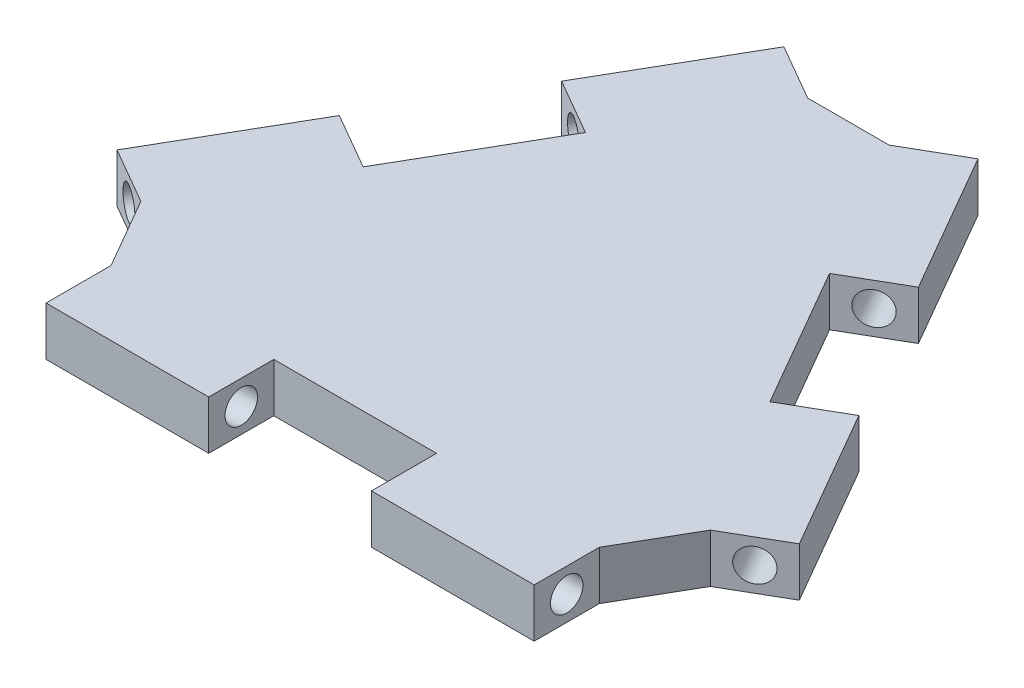
ISO-10303-21;
HEADER;
FILE_DESCRIPTION(('STEP AP214'),'2;1');
FILE_NAME('part.step','',(''),(''),'','','');
FILE_SCHEMA(('AUTOMOTIVE_DESIGN { 1 0 10303 214 1 1 1 1 }'));
ENDSEC;
DATA;
#1=APPLICATION_CONTEXT('core data for automotive mechanical design processes');
#2=APPLICATION_PROTOCOL_DEFINITION('international standard','automotive_design',2000,#1);
#3=PRODUCT_CONTEXT('',#1,'mechanical');
#4=PRODUCT('Part','Part','',(#3));
#5=PRODUCT_RELATED_PRODUCT_CATEGORY('part','',(#4));
#6=PRODUCT_DEFINITION_FORMATION('','',#4);
#7=PRODUCT_DEFINITION_CONTEXT('part definition',#1,'design');
#8=PRODUCT_DEFINITION('design','',#6,#7);
#9=PRODUCT_DEFINITION_SHAPE('','',#8);
#10=(LENGTH_UNIT() NAMED_UNIT(*) SI_UNIT(.MILLI.,.METRE.));
#11=(NAMED_UNIT(*) PLANE_ANGLE_UNIT() SI_UNIT($,.RADIAN.));
#12=(NAMED_UNIT(*) SI_UNIT($,.STERADIAN.) SOLID_ANGLE_UNIT());
#13=UNCERTAINTY_MEASURE_WITH_UNIT(LENGTH_MEASURE(1.E-05),#10,'distance_accuracy_value','');
#14=(GEOMETRIC_REPRESENTATION_CONTEXT(3) GLOBAL_UNCERTAINTY_ASSIGNED_CONTEXT((#13)) GLOBAL_UNIT_ASSIGNED_CONTEXT((#10,
#11,#12)) REPRESENTATION_CONTEXT('',''));
#15=CARTESIAN_POINT('',(0.,0.,0.));
#16=DIRECTION('',(0.,0.,1.));
#17=DIRECTION('',(1.,0.,0.));
#18=AXIS2_PLACEMENT_3D('',#15,#16,#17);
#19=CARTESIAN_POINT('',(-2.49999999999999,3.,4.33012701892219));
#20=DIRECTION('',(-0.499999999999999,0.,0.866025403784439));
#21=DIRECTION('',(0.866025403784439,0.,0.499999999999999));
#22=AXIS2_PLACEMENT_3D('',#19,#20,#21);
#23=PLANE('',#22);
#24=CARTESIAN_POINT('',(-19.2320508075689,1.5,-5.33012701892219));
#25=DIRECTION('',(0.499999999999999,0.,-0.866025403784439));
#26=DIRECTION('',(-0.866025403784439,0.,-0.5));
#27=AXIS2_PLACEMENT_3D('',#24,#25,#26);
#28=CIRCLE('',#27,1.00000000000001);
#29=CARTESIAN_POINT('',(-20.0980762113533,1.5,-5.83012701892219));
#30=VERTEX_POINT('',#29);
#31=EDGE_CURVE('E444',#30,#30,#28,.T.);
#32=ORIENTED_EDGE('',*,*,#31,.T.);
#33=EDGE_LOOP('',(#32));
#34=FACE_BOUND('',#33,.T.);
#35=DIRECTION('',(-0.866025403784439,0.,-0.499999999999999));
#36=VECTOR('',#35,1.);
#37=CARTESIAN_POINT('',(-2.49999999999999,0.,4.33012701892219));
#38=LINE('',#37,#36);
#39=CARTESIAN_POINT('',(-17.5,0.,-4.33012701892219));
#40=VERTEX_POINT('',#39);
#41=CARTESIAN_POINT('',(-20.9641016151378,0.,-6.33012701892219));
#42=VERTEX_POINT('',#41);
#43=EDGE_CURVE('E221',#40,#42,#38,.T.);
#44=ORIENTED_EDGE('',*,*,#43,.F.);
#45=DIRECTION('',(0.,-1.,0.));
#46=VECTOR('',#45,1.);
#47=CARTESIAN_POINT('',(-17.5,3.,-4.33012701892219));
#48=LINE('',#47,#46);
#49=CARTESIAN_POINT('',(-17.5,3.,-4.33012701892219));
#50=VERTEX_POINT('',#49);
#51=EDGE_CURVE('E325',#50,#40,#48,.T.);
#52=ORIENTED_EDGE('',*,*,#51,.F.);
#53=DIRECTION('',(-0.866025403784439,0.,-0.499999999999999));
#54=VECTOR('',#53,1.);
#55=CARTESIAN_POINT('',(-2.49999999999999,3.,4.33012701892219));
#56=LINE('',#55,#54);
#57=CARTESIAN_POINT('',(-20.9641016151378,3.,-6.33012701892219));
#58=VERTEX_POINT('',#57);
#59=EDGE_CURVE('E272',#50,#58,#56,.T.);
#60=ORIENTED_EDGE('',*,*,#59,.T.);
#61=DIRECTION('',(0.,-1.,0.));
#62=VECTOR('',#61,1.);
#63=CARTESIAN_POINT('',(-20.9641016151378,3.,-6.33012701892219));
#64=LINE('',#63,#62);
#65=EDGE_CURVE('E67',#58,#42,#64,.T.);
#66=ORIENTED_EDGE('',*,*,#65,.T.);
#67=EDGE_LOOP('',(#44,#52,#60,#66));
#68=FACE_BOUND('',#67,.T.);
#69=ADVANCED_FACE('F49',(#34,#68),#23,.T.);
#70=CARTESIAN_POINT('',(-15.,3.,0.));
#71=DIRECTION('',(1.,0.,0.));
#72=DIRECTION('',(0.,0.,-1.));
#73=AXIS2_PLACEMENT_3D('',#70,#71,#72);
#74=PLANE('',#73);
#75=CARTESIAN_POINT('',(-15.,1.5,2.00000000000004));
#76=DIRECTION('',(1.,0.,0.));
#77=DIRECTION('',(0.,0.,-1.));
#78=AXIS2_PLACEMENT_3D('',#75,#76,#77);
#79=CIRCLE('',#78,1.);
#80=CARTESIAN_POINT('',(-15.,1.5,1.00000000000004));
#81=VERTEX_POINT('',#80);
#82=EDGE_CURVE('E361',#81,#81,#79,.T.);
#83=ORIENTED_EDGE('',*,*,#82,.T.);
#84=EDGE_LOOP('',(#83));
#85=FACE_BOUND('',#84,.T.);
#86=DIRECTION('',(0.,0.,1.));
#87=VECTOR('',#86,1.);
#88=CARTESIAN_POINT('',(-15.,0.,0.));
#89=LINE('',#88,#87);
#90=CARTESIAN_POINT('',(-15.,0.,0.));
#91=VERTEX_POINT('',#90);
#92=CARTESIAN_POINT('',(-15.,0.,3.99999999999999));
#93=VERTEX_POINT('',#92);
#94=EDGE_CURVE('E223',#91,#93,#89,.T.);
#95=ORIENTED_EDGE('',*,*,#94,.T.);
#96=DIRECTION('',(0.,-1.,0.));
#97=VECTOR('',#96,1.);
#98=CARTESIAN_POINT('',(-15.,3.,3.99999999999999));
#99=LINE('',#98,#97);
#100=CARTESIAN_POINT('',(-15.,3.,3.99999999999999));
#101=VERTEX_POINT('',#100);
#102=EDGE_CURVE('E319',#101,#93,#99,.T.);
#103=ORIENTED_EDGE('',*,*,#102,.F.);
#104=DIRECTION('',(0.,0.,1.));
#105=VECTOR('',#104,1.);
#106=CARTESIAN_POINT('',(-15.,3.,0.));
#107=LINE('',#106,#105);
#108=CARTESIAN_POINT('',(-15.,3.,0.));
#109=VERTEX_POINT('',#108);
#110=EDGE_CURVE('E146',#109,#101,#107,.T.);
#111=ORIENTED_EDGE('',*,*,#110,.F.);
#112=DIRECTION('',(0.,-1.,0.));
#113=VECTOR('',#112,1.);
#114=CARTESIAN_POINT('',(-15.,3.,0.));
#115=LINE('',#114,#113);
#116=EDGE_CURVE('E322',#109,#91,#115,.T.);
#117=ORIENTED_EDGE('',*,*,#116,.T.);
#118=EDGE_LOOP('',(#95,#103,#111,#117));
#119=FACE_BOUND('',#118,.T.);
#120=ADVANCED_FACE('F435',(#85,#119),#74,.F.);
#121=CARTESIAN_POINT('',(0.,3.,4.));
#122=DIRECTION('',(0.,0.,-1.));
#123=DIRECTION('',(-1.,0.,0.));
#124=AXIS2_PLACEMENT_3D('',#121,#122,#123);
#125=PLANE('',#124);
#126=DIRECTION('',(1.,0.,0.));
#127=VECTOR('',#126,1.);
#128=CARTESIAN_POINT('',(0.,0.,4.));
#129=LINE('',#128,#127);
#130=CARTESIAN_POINT('',(-5.00000000000001,0.,4.));
#131=VERTEX_POINT('',#130);
#132=EDGE_CURVE('E226',#93,#131,#129,.T.);
#133=ORIENTED_EDGE('',*,*,#132,.T.);
#134=DIRECTION('',(0.,-1.,0.));
#135=VECTOR('',#134,1.);
#136=CARTESIAN_POINT('',(-5.00000000000001,3.,4.));
#137=LINE('',#136,#135);
#138=CARTESIAN_POINT('',(-5.00000000000001,3.,4.));
#139=VERTEX_POINT('',#138);
#140=EDGE_CURVE('E316',#139,#131,#137,.T.);
#141=ORIENTED_EDGE('',*,*,#140,.F.);
#142=DIRECTION('',(1.,0.,0.));
#143=VECTOR('',#142,1.);
#144=CARTESIAN_POINT('',(0.,3.,4.));
#145=LINE('',#144,#143);
#146=EDGE_CURVE('E374',#101,#139,#145,.T.);
#147=ORIENTED_EDGE('',*,*,#146,.F.);
#148=ORIENTED_EDGE('',*,*,#102,.T.);
#149=EDGE_LOOP('',(#133,#141,#147,#148));
#150=FACE_BOUND('',#149,.T.);
#151=ADVANCED_FACE('F440',(#150),#125,.F.);
#152=CARTESIAN_POINT('',(-5.00000000000001,3.,0.));
#153=DIRECTION('',(-1.,0.,0.));
#154=DIRECTION('',(0.,0.,1.));
#155=AXIS2_PLACEMENT_3D('',#152,#153,#154);
#156=PLANE('',#155);
#157=CARTESIAN_POINT('',(-5.00000000000001,1.5,2.00000000000002));
#158=DIRECTION('',(-1.,0.,0.));
#159=DIRECTION('',(0.,0.,1.));
#160=AXIS2_PLACEMENT_3D('',#157,#158,#159);
#161=CIRCLE('',#160,1.);
#162=CARTESIAN_POINT('',(-5.00000000000001,1.5,3.00000000000003));
#163=VERTEX_POINT('',#162);
#164=EDGE_CURVE('E358',#163,#163,#161,.T.);
#165=ORIENTED_EDGE('',*,*,#164,.T.);
#166=EDGE_LOOP('',(#165));
#167=FACE_BOUND('',#166,.T.);
#168=DIRECTION('',(0.,0.,-1.));
#169=VECTOR('',#168,1.);
#170=CARTESIAN_POINT('',(-5.00000000000001,0.,0.));
#171=LINE('',#170,#169);
#172=CARTESIAN_POINT('',(-5.00000000000001,0.,0.));
#173=VERTEX_POINT('',#172);
#174=EDGE_CURVE('E228',#131,#173,#171,.T.);
#175=ORIENTED_EDGE('',*,*,#174,.T.);
#176=DIRECTION('',(0.,-1.,0.));
#177=VECTOR('',#176,1.);
#178=CARTESIAN_POINT('',(-5.00000000000001,3.,0.));
#179=LINE('',#178,#177);
#180=CARTESIAN_POINT('',(-5.00000000000001,3.,0.));
#181=VERTEX_POINT('',#180);
#182=EDGE_CURVE('E313',#181,#173,#179,.T.);
#183=ORIENTED_EDGE('',*,*,#182,.F.);
#184=DIRECTION('',(0.,0.,-1.));
#185=VECTOR('',#184,1.);
#186=CARTESIAN_POINT('',(-5.00000000000001,3.,0.));
#187=LINE('',#186,#185);
#188=EDGE_CURVE('E376',#139,#181,#187,.T.);
#189=ORIENTED_EDGE('',*,*,#188,.F.);
#190=ORIENTED_EDGE('',*,*,#140,.T.);
#191=EDGE_LOOP('',(#175,#183,#189,#190));
#192=FACE_BOUND('',#191,.T.);
#193=ADVANCED_FACE('F466',(#167,#192),#156,.F.);
#194=CARTESIAN_POINT('',(0.,3.,0.));
#195=DIRECTION('',(0.,0.,-1.));
#196=DIRECTION('',(-1.,0.,0.));
#197=AXIS2_PLACEMENT_3D('',#194,#195,#196);
#198=PLANE('',#197);
#199=DIRECTION('',(1.,0.,0.));
#200=VECTOR('',#199,1.);
#201=CARTESIAN_POINT('',(0.,0.,0.));
#202=LINE('',#201,#200);
#203=CARTESIAN_POINT('',(5.,0.,0.));
#204=VERTEX_POINT('',#203);
#205=EDGE_CURVE('E230',#173,#204,#202,.T.);
#206=ORIENTED_EDGE('',*,*,#205,.T.);
#207=DIRECTION('',(0.,-1.,0.));
#208=VECTOR('',#207,1.);
#209=CARTESIAN_POINT('',(5.,3.,0.));
#210=LINE('',#209,#208);
#211=CARTESIAN_POINT('',(5.,3.,0.));
#212=VERTEX_POINT('',#211);
#213=EDGE_CURVE('E311',#212,#204,#210,.T.);
#214=ORIENTED_EDGE('',*,*,#213,.F.);
#215=DIRECTION('',(1.,0.,0.));
#216=VECTOR('',#215,1.);
#217=CARTESIAN_POINT('',(0.,3.,0.));
#218=LINE('',#217,#216);
#219=EDGE_CURVE('E378',#181,#212,#218,.T.);
#220=ORIENTED_EDGE('',*,*,#219,.F.);
#221=ORIENTED_EDGE('',*,*,#182,.T.);
#222=EDGE_LOOP('',(#206,#214,#220,#221));
#223=FACE_BOUND('',#222,.T.);
#224=ADVANCED_FACE('F470',(#223),#198,.F.);
#225=CARTESIAN_POINT('',(5.,3.,0.));
#226=DIRECTION('',(-1.,0.,0.));
#227=DIRECTION('',(0.,0.,1.));
#228=AXIS2_PLACEMENT_3D('',#225,#226,#227);
#229=PLANE('',#228);
#230=CARTESIAN_POINT('',(5.,1.5,2.00000000000001));
#231=DIRECTION('',(-1.,0.,0.));
#232=DIRECTION('',(0.,0.,1.));
#233=AXIS2_PLACEMENT_3D('',#230,#231,#232);
#234=CIRCLE('',#233,1.);
#235=CARTESIAN_POINT('',(5.00000000000001,1.5,3.00000000000001));
#236=VERTEX_POINT('',#235);
#237=EDGE_CURVE('E355',#236,#236,#234,.T.);
#238=ORIENTED_EDGE('',*,*,#237,.F.);
#239=EDGE_LOOP('',(#238));
#240=FACE_BOUND('',#239,.T.);
#241=DIRECTION('',(0.,0.,-1.));
#242=VECTOR('',#241,1.);
#243=CARTESIAN_POINT('',(5.,0.,0.));
#244=LINE('',#243,#242);
#245=CARTESIAN_POINT('',(5.00000000000001,0.,4.));
#246=VERTEX_POINT('',#245);
#247=EDGE_CURVE('E233',#246,#204,#244,.T.);
#248=ORIENTED_EDGE('',*,*,#247,.F.);
#249=DIRECTION('',(0.,-1.,0.));
#250=VECTOR('',#249,1.);
#251=CARTESIAN_POINT('',(5.00000000000001,3.,4.));
#252=LINE('',#251,#250);
#253=CARTESIAN_POINT('',(5.00000000000001,3.,4.));
#254=VERTEX_POINT('',#253);
#255=EDGE_CURVE('E309',#254,#246,#252,.T.);
#256=ORIENTED_EDGE('',*,*,#255,.F.);
#257=DIRECTION('',(0.,0.,-1.));
#258=VECTOR('',#257,1.);
#259=CARTESIAN_POINT('',(5.,3.,0.));
#260=LINE('',#259,#258);
#261=EDGE_CURVE('E380',#254,#212,#260,.T.);
#262=ORIENTED_EDGE('',*,*,#261,.T.);
#263=ORIENTED_EDGE('',*,*,#213,.T.);
#264=EDGE_LOOP('',(#248,#256,#262,#263));
#265=FACE_BOUND('',#264,.T.);
#266=ADVANCED_FACE('F473',(#240,#265),#229,.T.);
#267=CARTESIAN_POINT('',(0.,3.,4.));
#268=DIRECTION('',(0.,0.,1.));
#269=DIRECTION('',(1.,0.,0.));
#270=AXIS2_PLACEMENT_3D('',#267,#268,#269);
#271=PLANE('',#270);
#272=DIRECTION('',(-1.,0.,0.));
#273=VECTOR('',#272,1.);
#274=CARTESIAN_POINT('',(0.,0.,4.));
#275=LINE('',#274,#273);
#276=CARTESIAN_POINT('',(15.,0.,4.));
#277=VERTEX_POINT('',#276);
#278=EDGE_CURVE('E236',#277,#246,#275,.T.);
#279=ORIENTED_EDGE('',*,*,#278,.F.);
#280=DIRECTION('',(0.,-1.,0.));
#281=VECTOR('',#280,1.);
#282=CARTESIAN_POINT('',(15.,3.,4.));
#283=LINE('',#282,#281);
#284=CARTESIAN_POINT('',(15.,3.,4.));
#285=VERTEX_POINT('',#284);
#286=EDGE_CURVE('E307',#285,#277,#283,.T.);
#287=ORIENTED_EDGE('',*,*,#286,.F.);
#288=DIRECTION('',(-1.,0.,0.));
#289=VECTOR('',#288,1.);
#290=CARTESIAN_POINT('',(0.,3.,4.));
#291=LINE('',#290,#289);
#292=EDGE_CURVE('E383',#285,#254,#291,.T.);
#293=ORIENTED_EDGE('',*,*,#292,.T.);
#294=ORIENTED_EDGE('',*,*,#255,.T.);
#295=EDGE_LOOP('',(#279,#287,#293,#294));
#296=FACE_BOUND('',#295,.T.);
#297=ADVANCED_FACE('F478',(#296),#271,.T.);
#298=CARTESIAN_POINT('',(15.,3.,0.));
#299=DIRECTION('',(1.,0.,0.));
#300=DIRECTION('',(0.,0.,-1.));
#301=AXIS2_PLACEMENT_3D('',#298,#299,#300);
#302=PLANE('',#301);
#303=CARTESIAN_POINT('',(15.,1.5,2.));
#304=DIRECTION('',(1.,0.,0.));
#305=DIRECTION('',(0.,0.,-1.));
#306=AXIS2_PLACEMENT_3D('',#303,#304,#305);
#307=CIRCLE('',#306,1.);
#308=CARTESIAN_POINT('',(15.,1.5,0.999999999999999));
#309=VERTEX_POINT('',#308);
#310=EDGE_CURVE('E352',#309,#309,#307,.T.);
#311=ORIENTED_EDGE('',*,*,#310,.F.);
#312=EDGE_LOOP('',(#311));
#313=FACE_BOUND('',#312,.T.);
#314=DIRECTION('',(0.,0.,1.));
#315=VECTOR('',#314,1.);
#316=CARTESIAN_POINT('',(15.,0.,0.));
#317=LINE('',#316,#315);
#318=CARTESIAN_POINT('',(15.,0.,0.));
#319=VERTEX_POINT('',#318);
#320=EDGE_CURVE('E239',#319,#277,#317,.T.);
#321=ORIENTED_EDGE('',*,*,#320,.F.);
#322=DIRECTION('',(0.,-1.,0.));
#323=VECTOR('',#322,1.);
#324=CARTESIAN_POINT('',(15.,3.,0.));
#325=LINE('',#324,#323);
#326=CARTESIAN_POINT('',(15.,3.,0.));
#327=VERTEX_POINT('',#326);
#328=EDGE_CURVE('E305',#327,#319,#325,.T.);
#329=ORIENTED_EDGE('',*,*,#328,.F.);
#330=DIRECTION('',(0.,0.,1.));
#331=VECTOR('',#330,1.);
#332=CARTESIAN_POINT('',(15.,3.,0.));
#333=LINE('',#332,#331);
#334=EDGE_CURVE('E386',#327,#285,#333,.T.);
#335=ORIENTED_EDGE('',*,*,#334,.T.);
#336=ORIENTED_EDGE('',*,*,#286,.T.);
#337=EDGE_LOOP('',(#321,#329,#335,#336));
#338=FACE_BOUND('',#337,.T.);
#339=ADVANCED_FACE('F481',(#313,#338),#302,.T.);
#340=CARTESIAN_POINT('',(2.49999999999999,3.,4.33012701892219));
#341=DIRECTION('',(-0.499999999999999,0.,-0.866025403784439));
#342=DIRECTION('',(-0.866025403784439,0.,0.499999999999999));
#343=AXIS2_PLACEMENT_3D('',#340,#341,#342);
#344=PLANE('',#343);
#345=CARTESIAN_POINT('',(19.2320508075689,1.5,-5.33012701892219));
#346=DIRECTION('',(0.499999999999999,0.,0.866025403784439));
#347=DIRECTION('',(0.866025403784439,0.,-0.5));
#348=AXIS2_PLACEMENT_3D('',#345,#346,#347);
#349=CIRCLE('',#348,1.00000000000001);
#350=CARTESIAN_POINT('',(20.0980762113533,1.5,-5.83012701892219));
#351=VERTEX_POINT('',#350);
#352=EDGE_CURVE('E334',#351,#351,#349,.T.);
#353=ORIENTED_EDGE('',*,*,#352,.F.);
#354=EDGE_LOOP('',(#353));
#355=FACE_BOUND('',#354,.T.);
#356=DIRECTION('',(0.866025403784439,0.,-0.499999999999999));
#357=VECTOR('',#356,1.);
#358=CARTESIAN_POINT('',(2.49999999999999,0.,4.33012701892219));
#359=LINE('',#358,#357);
#360=CARTESIAN_POINT('',(17.5,0.,-4.33012701892219));
#361=VERTEX_POINT('',#360);
#362=CARTESIAN_POINT('',(20.9641016151378,0.,-6.33012701892219));
#363=VERTEX_POINT('',#362);
#364=EDGE_CURVE('E242',#361,#363,#359,.T.);
#365=ORIENTED_EDGE('',*,*,#364,.T.);
#366=DIRECTION('',(0.,-1.,0.));
#367=VECTOR('',#366,1.);
#368=CARTESIAN_POINT('',(20.9641016151378,3.,-6.33012701892219));
#369=LINE('',#368,#367);
#370=CARTESIAN_POINT('',(20.9641016151378,3.,-6.33012701892219));
#371=VERTEX_POINT('',#370);
#372=EDGE_CURVE('E299',#371,#363,#369,.T.);
#373=ORIENTED_EDGE('',*,*,#372,.F.);
#374=DIRECTION('',(0.866025403784439,0.,-0.499999999999999));
#375=VECTOR('',#374,1.);
#376=CARTESIAN_POINT('',(2.49999999999999,3.,4.33012701892219));
#377=LINE('',#376,#375);
#378=CARTESIAN_POINT('',(17.5,3.,-4.33012701892219));
#379=VERTEX_POINT('',#378);
#380=EDGE_CURVE('E389',#379,#371,#377,.T.);
#381=ORIENTED_EDGE('',*,*,#380,.F.);
#382=DIRECTION('',(0.,-1.,0.));
#383=VECTOR('',#382,1.);
#384=CARTESIAN_POINT('',(17.5,3.,-4.33012701892219));
#385=LINE('',#384,#383);
#386=EDGE_CURVE('E302',#379,#361,#385,.T.);
#387=ORIENTED_EDGE('',*,*,#386,.T.);
#388=EDGE_LOOP('',(#365,#373,#381,#387));
#389=FACE_BOUND('',#388,.T.);
#390=ADVANCED_FACE('F540',(#355,#389),#344,.F.);
#391=CARTESIAN_POINT('',(18.4641016151378,3.,-10.6602540378444));
#392=DIRECTION('',(-0.866025403784439,0.,0.5));
#393=DIRECTION('',(0.5,0.,0.866025403784439));
#394=AXIS2_PLACEMENT_3D('',#391,#392,#393);
#395=PLANE('',#394);
#396=DIRECTION('',(-0.5,0.,-0.866025403784439));
#397=VECTOR('',#396,1.);
#398=CARTESIAN_POINT('',(18.4641016151378,0.,-10.6602540378444));
#399=LINE('',#398,#397);
#400=CARTESIAN_POINT('',(15.9641016151378,0.,-14.9903810567666));
#401=VERTEX_POINT('',#400);
#402=EDGE_CURVE('E244',#363,#401,#399,.T.);
#403=ORIENTED_EDGE('',*,*,#402,.T.);
#404=DIRECTION('',(0.,-1.,0.));
#405=VECTOR('',#404,1.);
#406=CARTESIAN_POINT('',(15.9641016151378,3.,-14.9903810567666));
#407=LINE('',#406,#405);
#408=CARTESIAN_POINT('',(15.9641016151378,3.,-14.9903810567666));
#409=VERTEX_POINT('',#408);
#410=EDGE_CURVE('E296',#409,#401,#407,.T.);
#411=ORIENTED_EDGE('',*,*,#410,.F.);
#412=DIRECTION('',(-0.5,0.,-0.866025403784439));
#413=VECTOR('',#412,1.);
#414=CARTESIAN_POINT('',(18.4641016151378,3.,-10.6602540378444));
#415=LINE('',#414,#413);
#416=EDGE_CURVE('E391',#371,#409,#415,.T.);
#417=ORIENTED_EDGE('',*,*,#416,.F.);
#418=ORIENTED_EDGE('',*,*,#372,.T.);
#419=EDGE_LOOP('',(#403,#411,#417,#418));
#420=FACE_BOUND('',#419,.T.);
#421=ADVANCED_FACE('F536',(#420),#395,.F.);
#422=CARTESIAN_POINT('',(-2.5,3.,-4.3301270189222));
#423=DIRECTION('',(0.499999999999999,0.,0.866025403784439));
#424=DIRECTION('',(0.866025403784439,0.,-0.499999999999999));
#425=AXIS2_PLACEMENT_3D('',#422,#423,#424);
#426=PLANE('',#425);
#427=CARTESIAN_POINT('',(14.2320508075689,1.5,-13.9903810567666));
#428=DIRECTION('',(0.499999999999999,0.,0.866025403784439));
#429=DIRECTION('',(0.866025403784439,0.,-0.499999999999999));
#430=AXIS2_PLACEMENT_3D('',#427,#428,#429);
#431=CIRCLE('',#430,1.00000000000001);
#432=CARTESIAN_POINT('',(15.0980762113533,1.5,-14.4903810567666));
#433=VERTEX_POINT('',#432);
#434=EDGE_CURVE('E338',#433,#433,#431,.T.);
#435=ORIENTED_EDGE('',*,*,#434,.T.);
#436=EDGE_LOOP('',(#435));
#437=FACE_BOUND('',#436,.T.);
#438=DIRECTION('',(-0.866025403784439,0.,0.499999999999999));
#439=VECTOR('',#438,1.);
#440=CARTESIAN_POINT('',(-2.5,0.,-4.3301270189222));
#441=LINE('',#440,#439);
#442=CARTESIAN_POINT('',(12.5,0.,-12.9903810567666));
#443=VERTEX_POINT('',#442);
#444=EDGE_CURVE('E246',#401,#443,#441,.T.);
#445=ORIENTED_EDGE('',*,*,#444,.T.);
#446=DIRECTION('',(0.,-1.,0.));
#447=VECTOR('',#446,1.);
#448=CARTESIAN_POINT('',(12.5,3.,-12.9903810567666));
#449=LINE('',#448,#447);
#450=CARTESIAN_POINT('',(12.5,3.,-12.9903810567666));
#451=VERTEX_POINT('',#450);
#452=EDGE_CURVE('E293',#451,#443,#449,.T.);
#453=ORIENTED_EDGE('',*,*,#452,.F.);
#454=DIRECTION('',(-0.866025403784439,0.,0.499999999999999));
#455=VECTOR('',#454,1.);
#456=CARTESIAN_POINT('',(-2.5,3.,-4.3301270189222));
#457=LINE('',#456,#455);
#458=EDGE_CURVE('E393',#409,#451,#457,.T.);
#459=ORIENTED_EDGE('',*,*,#458,.F.);
#460=ORIENTED_EDGE('',*,*,#410,.T.);
#461=EDGE_LOOP('',(#445,#453,#459,#460));
#462=FACE_BOUND('',#461,.T.);
#463=ADVANCED_FACE('F532',(#437,#462),#426,.F.);
#464=CARTESIAN_POINT('',(15.,3.,-8.66025403784439));
#465=DIRECTION('',(-0.866025403784439,0.,0.5));
#466=DIRECTION('',(0.5,0.,0.866025403784439));
#467=AXIS2_PLACEMENT_3D('',#464,#465,#466);
#468=PLANE('',#467);
#469=DIRECTION('',(-0.5,0.,-0.866025403784439));
#470=VECTOR('',#469,1.);
#471=CARTESIAN_POINT('',(15.,0.,-8.66025403784439));
#472=LINE('',#471,#470);
#473=CARTESIAN_POINT('',(7.5,0.,-21.650635094611));
#474=VERTEX_POINT('',#473);
#475=EDGE_CURVE('E248',#443,#474,#472,.T.);
#476=ORIENTED_EDGE('',*,*,#475,.T.);
#477=DIRECTION('',(0.,-1.,0.));
#478=VECTOR('',#477,1.);
#479=CARTESIAN_POINT('',(7.5,3.,-21.650635094611));
#480=LINE('',#479,#478);
#481=CARTESIAN_POINT('',(7.5,3.,-21.650635094611));
#482=VERTEX_POINT('',#481);
#483=EDGE_CURVE('E291',#482,#474,#480,.T.);
#484=ORIENTED_EDGE('',*,*,#483,.F.);
#485=DIRECTION('',(-0.5,0.,-0.866025403784439));
#486=VECTOR('',#485,1.);
#487=CARTESIAN_POINT('',(15.,3.,-8.66025403784439));
#488=LINE('',#487,#486);
#489=EDGE_CURVE('E395',#451,#482,#488,.T.);
#490=ORIENTED_EDGE('',*,*,#489,.F.);
#491=ORIENTED_EDGE('',*,*,#452,.T.);
#492=EDGE_LOOP('',(#476,#484,#490,#491));
#493=FACE_BOUND('',#492,.T.);
#494=ADVANCED_FACE('F528',(#493),#468,.F.);
#495=CARTESIAN_POINT('',(-7.50000000000001,3.,-12.9903810567666));
#496=DIRECTION('',(0.5,0.,0.866025403784438));
#497=DIRECTION('',(0.866025403784438,0.,-0.5));
#498=AXIS2_PLACEMENT_3D('',#495,#496,#497);
#499=PLANE('',#498);
#500=CARTESIAN_POINT('',(9.23205080756888,1.5,-22.650635094611));
#501=DIRECTION('',(0.5,0.,0.866025403784438));
#502=DIRECTION('',(0.866025403784438,0.,-0.5));
#503=AXIS2_PLACEMENT_3D('',#500,#501,#502);
#504=CIRCLE('',#503,1.00000000000001);
#505=CARTESIAN_POINT('',(10.0980762113533,1.5,-23.150635094611));
#506=VERTEX_POINT('',#505);
#507=EDGE_CURVE('E333',#506,#506,#504,.T.);
#508=ORIENTED_EDGE('',*,*,#507,.F.);
#509=EDGE_LOOP('',(#508));
#510=FACE_BOUND('',#509,.T.);
#511=DIRECTION('',(-0.866025403784438,0.,0.5));
#512=VECTOR('',#511,1.);
#513=CARTESIAN_POINT('',(-7.50000000000001,0.,-12.9903810567666));
#514=LINE('',#513,#512);
#515=CARTESIAN_POINT('',(10.9641016151377,0.,-23.650635094611));
#516=VERTEX_POINT('',#515);
#517=EDGE_CURVE('E251',#516,#474,#514,.T.);
#518=ORIENTED_EDGE('',*,*,#517,.F.);
#519=DIRECTION('',(0.,-1.,0.));
#520=VECTOR('',#519,1.);
#521=CARTESIAN_POINT('',(10.9641016151377,3.,-23.650635094611));
#522=LINE('',#521,#520);
#523=CARTESIAN_POINT('',(10.9641016151377,3.,-23.650635094611));
#524=VERTEX_POINT('',#523);
#525=EDGE_CURVE('E289',#524,#516,#522,.T.);
#526=ORIENTED_EDGE('',*,*,#525,.F.);
#527=DIRECTION('',(-0.866025403784438,0.,0.5));
#528=VECTOR('',#527,1.);
#529=CARTESIAN_POINT('',(-7.50000000000001,3.,-12.9903810567666));
#530=LINE('',#529,#528);
#531=EDGE_CURVE('E397',#524,#482,#530,.T.);
#532=ORIENTED_EDGE('',*,*,#531,.T.);
#533=ORIENTED_EDGE('',*,*,#483,.T.);
#534=EDGE_LOOP('',(#518,#526,#532,#533));
#535=FACE_BOUND('',#534,.T.);
#536=ADVANCED_FACE('F524',(#510,#535),#499,.T.);
#537=CARTESIAN_POINT('',(18.4641016151378,3.,-10.6602540378444));
#538=DIRECTION('',(0.866025403784438,0.,-0.5));
#539=DIRECTION('',(-0.5,0.,-0.866025403784439));
#540=AXIS2_PLACEMENT_3D('',#537,#538,#539);
#541=PLANE('',#540);
#542=DIRECTION('',(0.5,0.,0.866025403784439));
#543=VECTOR('',#542,1.);
#544=CARTESIAN_POINT('',(18.4641016151378,0.,-10.6602540378444));
#545=LINE('',#544,#543);
#546=CARTESIAN_POINT('',(5.96410161513775,0.,-32.3108891324554));
#547=VERTEX_POINT('',#546);
#548=EDGE_CURVE('E254',#547,#516,#545,.T.);
#549=ORIENTED_EDGE('',*,*,#548,.F.);
#550=DIRECTION('',(0.,-1.,0.));
#551=VECTOR('',#550,1.);
#552=CARTESIAN_POINT('',(5.96410161513775,3.,-32.3108891324554));
#553=LINE('',#552,#551);
#554=CARTESIAN_POINT('',(5.96410161513775,3.,-32.3108891324554));
#555=VERTEX_POINT('',#554);
#556=EDGE_CURVE('E287',#555,#547,#553,.T.);
#557=ORIENTED_EDGE('',*,*,#556,.F.);
#558=DIRECTION('',(0.5,0.,0.866025403784439));
#559=VECTOR('',#558,1.);
#560=CARTESIAN_POINT('',(18.4641016151378,3.,-10.6602540378444));
#561=LINE('',#560,#559);
#562=EDGE_CURVE('E400',#555,#524,#561,.T.);
#563=ORIENTED_EDGE('',*,*,#562,.T.);
#564=ORIENTED_EDGE('',*,*,#525,.T.);
#565=EDGE_LOOP('',(#549,#557,#563,#564));
#566=FACE_BOUND('',#565,.T.);
#567=ADVANCED_FACE('F516',(#566),#541,.T.);
#568=CARTESIAN_POINT('',(-12.5,3.,-21.6506350946109));
#569=DIRECTION('',(-0.500000000000001,0.,-0.866025403784438));
#570=DIRECTION('',(-0.866025403784438,0.,0.500000000000001));
#571=AXIS2_PLACEMENT_3D('',#568,#569,#570);
#572=PLANE('',#571);
#573=CARTESIAN_POINT('',(4.23205080756889,1.5,-31.3108891324554));
#574=DIRECTION('',(-0.500000000000001,0.,-0.866025403784438));
#575=DIRECTION('',(-0.866025403784438,0.,0.500000000000001));
#576=AXIS2_PLACEMENT_3D('',#573,#574,#575);
#577=CIRCLE('',#576,1.00000000000001);
#578=CARTESIAN_POINT('',(3.36602540378444,1.5,-30.8108891324554));
#579=VERTEX_POINT('',#578);
#580=EDGE_CURVE('E331',#579,#579,#577,.T.);
#581=ORIENTED_EDGE('',*,*,#580,.F.);
#582=EDGE_LOOP('',(#581));
#583=FACE_BOUND('',#582,.T.);
#584=DIRECTION('',(0.866025403784438,0.,-0.500000000000001));
#585=VECTOR('',#584,1.);
#586=CARTESIAN_POINT('',(-12.5,0.,-21.6506350946109));
#587=LINE('',#586,#585);
#588=CARTESIAN_POINT('',(2.5,0.,-30.3108891324554));
#589=VERTEX_POINT('',#588);
#590=EDGE_CURVE('E257',#589,#547,#587,.T.);
#591=ORIENTED_EDGE('',*,*,#590,.F.);
#592=DIRECTION('',(0.,-1.,0.));
#593=VECTOR('',#592,1.);
#594=CARTESIAN_POINT('',(2.5,3.,-30.3108891324554));
#595=LINE('',#594,#593);
#596=CARTESIAN_POINT('',(2.5,3.,-30.3108891324554));
#597=VERTEX_POINT('',#596);
#598=EDGE_CURVE('E285',#597,#589,#595,.T.);
#599=ORIENTED_EDGE('',*,*,#598,.F.);
#600=DIRECTION('',(0.866025403784438,0.,-0.500000000000001));
#601=VECTOR('',#600,1.);
#602=CARTESIAN_POINT('',(-12.5,3.,-21.6506350946109));
#603=LINE('',#602,#601);
#604=EDGE_CURVE('E403',#597,#555,#603,.T.);
#605=ORIENTED_EDGE('',*,*,#604,.T.);
#606=ORIENTED_EDGE('',*,*,#556,.T.);
#607=EDGE_LOOP('',(#591,#599,#605,#606));
#608=FACE_BOUND('',#607,.T.);
#609=ADVANCED_FACE('F508',(#583,#608),#572,.T.);
#610=CARTESIAN_POINT('',(12.5,3.,-21.6506350946109));
#611=DIRECTION('',(-0.500000000000001,0.,0.866025403784438));
#612=DIRECTION('',(0.866025403784438,0.,0.500000000000001));
#613=AXIS2_PLACEMENT_3D('',#610,#611,#612);
#614=PLANE('',#613);
#615=CARTESIAN_POINT('',(-4.23205080756889,1.5,-31.3108891324554));
#616=DIRECTION('',(-0.500000000000001,0.,0.866025403784438));
#617=DIRECTION('',(0.866025403784438,0.,0.500000000000001));
#618=AXIS2_PLACEMENT_3D('',#615,#616,#617);
#619=CIRCLE('',#618,1.00000000000001);
#620=CARTESIAN_POINT('',(-3.36602540378444,1.5,-30.8108891324554));
#621=VERTEX_POINT('',#620);
#622=EDGE_CURVE('E341',#621,#621,#619,.F.);
#623=ORIENTED_EDGE('',*,*,#622,.F.);
#624=EDGE_LOOP('',(#623));
#625=FACE_BOUND('',#624,.T.);
#626=DIRECTION('',(-0.866025403784438,0.,-0.500000000000001));
#627=VECTOR('',#626,1.);
#628=CARTESIAN_POINT('',(12.5,0.,-21.6506350946109));
#629=LINE('',#628,#627);
#630=CARTESIAN_POINT('',(-2.5,0.,-30.3108891324554));
#631=VERTEX_POINT('',#630);
#632=CARTESIAN_POINT('',(-5.96410161513775,0.,-32.3108891324554));
#633=VERTEX_POINT('',#632);
#634=EDGE_CURVE('E260',#631,#633,#629,.T.);
#635=ORIENTED_EDGE('',*,*,#634,.T.);
#636=DIRECTION('',(0.,-1.,0.));
#637=VECTOR('',#636,1.);
#638=CARTESIAN_POINT('',(-5.96410161513775,3.,-32.3108891324554));
#639=LINE('',#638,#637);
#640=CARTESIAN_POINT('',(-5.96410161513775,3.,-32.3108891324554));
#641=VERTEX_POINT('',#640);
#642=EDGE_CURVE('E279',#641,#633,#639,.T.);
#643=ORIENTED_EDGE('',*,*,#642,.F.);
#644=DIRECTION('',(-0.866025403784438,0.,-0.500000000000001));
#645=VECTOR('',#644,1.);
#646=CARTESIAN_POINT('',(12.5,3.,-21.6506350946109));
#647=LINE('',#646,#645);
#648=CARTESIAN_POINT('',(-2.5,3.,-30.3108891324554));
#649=VERTEX_POINT('',#648);
#650=EDGE_CURVE('E406',#649,#641,#647,.T.);
#651=ORIENTED_EDGE('',*,*,#650,.F.);
#652=DIRECTION('',(0.,-1.,0.));
#653=VECTOR('',#652,1.);
#654=CARTESIAN_POINT('',(-2.5,3.,-30.3108891324554));
#655=LINE('',#654,#653);
#656=EDGE_CURVE('E282',#649,#631,#655,.T.);
#657=ORIENTED_EDGE('',*,*,#656,.T.);
#658=EDGE_LOOP('',(#635,#643,#651,#657));
#659=FACE_BOUND('',#658,.T.);
#660=ADVANCED_FACE('F506',(#625,#659),#614,.F.);
#661=CARTESIAN_POINT('',(-18.4641016151378,3.,-10.6602540378444));
#662=DIRECTION('',(0.866025403784438,0.,0.5));
#663=DIRECTION('',(0.5,0.,-0.866025403784439));
#664=AXIS2_PLACEMENT_3D('',#661,#662,#663);
#665=PLANE('',#664);
#666=DIRECTION('',(-0.5,0.,0.866025403784439));
#667=VECTOR('',#666,1.);
#668=CARTESIAN_POINT('',(-18.4641016151378,0.,-10.6602540378444));
#669=LINE('',#668,#667);
#670=CARTESIAN_POINT('',(-10.9641016151377,0.,-23.650635094611));
#671=VERTEX_POINT('',#670);
#672=EDGE_CURVE('E262',#633,#671,#669,.T.);
#673=ORIENTED_EDGE('',*,*,#672,.T.);
#674=DIRECTION('',(0.,-1.,0.));
#675=VECTOR('',#674,1.);
#676=CARTESIAN_POINT('',(-10.9641016151377,3.,-23.650635094611));
#677=LINE('',#676,#675);
#678=CARTESIAN_POINT('',(-10.9641016151377,3.,-23.650635094611));
#679=VERTEX_POINT('',#678);
#680=EDGE_CURVE('E276',#679,#671,#677,.T.);
#681=ORIENTED_EDGE('',*,*,#680,.F.);
#682=DIRECTION('',(-0.5,0.,0.866025403784439));
#683=VECTOR('',#682,1.);
#684=CARTESIAN_POINT('',(-18.4641016151378,3.,-10.6602540378444));
#685=LINE('',#684,#683);
#686=EDGE_CURVE('E408',#641,#679,#685,.T.);
#687=ORIENTED_EDGE('',*,*,#686,.F.);
#688=ORIENTED_EDGE('',*,*,#642,.T.);
#689=EDGE_LOOP('',(#673,#681,#687,#688));
#690=FACE_BOUND('',#689,.T.);
#691=ADVANCED_FACE('F415',(#690),#665,.F.);
#692=CARTESIAN_POINT('',(7.50000000000001,3.,-12.9903810567666));
#693=DIRECTION('',(0.5,0.,-0.866025403784438));
#694=DIRECTION('',(-0.866025403784438,0.,-0.5));
#695=AXIS2_PLACEMENT_3D('',#692,#693,#694);
#696=PLANE('',#695);
#697=CARTESIAN_POINT('',(-9.23205080756888,1.5,-22.650635094611));
#698=DIRECTION('',(0.5,0.,-0.866025403784438));
#699=DIRECTION('',(-0.866025403784438,0.,-0.5));
#700=AXIS2_PLACEMENT_3D('',#697,#698,#699);
#701=CIRCLE('',#700,1.00000000000001);
#702=CARTESIAN_POINT('',(-10.0980762113533,1.5,-23.150635094611));
#703=VERTEX_POINT('',#702);
#704=EDGE_CURVE('E346',#703,#703,#701,.F.);
#705=ORIENTED_EDGE('',*,*,#704,.F.);
#706=EDGE_LOOP('',(#705));
#707=FACE_BOUND('',#706,.T.);
#708=DIRECTION('',(0.866025403784438,0.,0.5));
#709=VECTOR('',#708,1.);
#710=CARTESIAN_POINT('',(7.50000000000001,0.,-12.9903810567666));
#711=LINE('',#710,#709);
#712=CARTESIAN_POINT('',(-7.5,0.,-21.650635094611));
#713=VERTEX_POINT('',#712);
#714=EDGE_CURVE('E264',#671,#713,#711,.T.);
#715=ORIENTED_EDGE('',*,*,#714,.T.);
#716=DIRECTION('',(0.,-1.,0.));
#717=VECTOR('',#716,1.);
#718=CARTESIAN_POINT('',(-7.5,3.,-21.650635094611));
#719=LINE('',#718,#717);
#720=CARTESIAN_POINT('',(-7.5,3.,-21.650635094611));
#721=VERTEX_POINT('',#720);
#722=EDGE_CURVE('E213',#721,#713,#719,.T.);
#723=ORIENTED_EDGE('',*,*,#722,.F.);
#724=DIRECTION('',(0.866025403784438,0.,0.5));
#725=VECTOR('',#724,1.);
#726=CARTESIAN_POINT('',(7.50000000000001,3.,-12.9903810567666));
#727=LINE('',#726,#725);
#728=EDGE_CURVE('E201',#679,#721,#727,.T.);
#729=ORIENTED_EDGE('',*,*,#728,.F.);
#730=ORIENTED_EDGE('',*,*,#680,.T.);
#731=EDGE_LOOP('',(#715,#723,#729,#730));
#732=FACE_BOUND('',#731,.T.);
#733=ADVANCED_FACE('F419',(#707,#732),#696,.F.);
#734=CARTESIAN_POINT('',(-15.,3.,-8.66025403784439));
#735=DIRECTION('',(0.866025403784439,0.,0.5));
#736=DIRECTION('',(0.5,0.,-0.866025403784439));
#737=AXIS2_PLACEMENT_3D('',#734,#735,#736);
#738=PLANE('',#737);
#739=DIRECTION('',(-0.5,0.,0.866025403784439));
#740=VECTOR('',#739,1.);
#741=CARTESIAN_POINT('',(-15.,0.,-8.66025403784439));
#742=LINE('',#741,#740);
#743=CARTESIAN_POINT('',(-12.5,0.,-12.9903810567666));
#744=VERTEX_POINT('',#743);
#745=EDGE_CURVE('E210',#713,#744,#742,.T.);
#746=ORIENTED_EDGE('',*,*,#745,.T.);
#747=DIRECTION('',(0.,-1.,0.));
#748=VECTOR('',#747,1.);
#749=CARTESIAN_POINT('',(-12.5,3.,-12.9903810567666));
#750=LINE('',#749,#748);
#751=CARTESIAN_POINT('',(-12.5,3.,-12.9903810567666));
#752=VERTEX_POINT('',#751);
#753=EDGE_CURVE('E207',#752,#744,#750,.T.);
#754=ORIENTED_EDGE('',*,*,#753,.F.);
#755=DIRECTION('',(-0.5,0.,0.866025403784439));
#756=VECTOR('',#755,1.);
#757=CARTESIAN_POINT('',(-15.,3.,-8.66025403784439));
#758=LINE('',#757,#756);
#759=EDGE_CURVE('E193',#721,#752,#758,.T.);
#760=ORIENTED_EDGE('',*,*,#759,.F.);
#761=ORIENTED_EDGE('',*,*,#722,.T.);
#762=EDGE_LOOP('',(#746,#754,#760,#761));
#763=FACE_BOUND('',#762,.T.);
#764=ADVANCED_FACE('F208',(#763),#738,.F.);
#765=CARTESIAN_POINT('',(2.5,3.,-4.3301270189222));
#766=DIRECTION('',(0.499999999999999,0.,-0.866025403784439));
#767=DIRECTION('',(-0.866025403784439,0.,-0.499999999999999));
#768=AXIS2_PLACEMENT_3D('',#765,#766,#767);
#769=PLANE('',#768);
#770=CARTESIAN_POINT('',(-14.2320508075689,1.5,-13.9903810567666));
#771=DIRECTION('',(0.499999999999999,0.,-0.866025403784439));
#772=DIRECTION('',(-0.866025403784439,0.,-0.499999999999999));
#773=AXIS2_PLACEMENT_3D('',#770,#771,#772);
#774=CIRCLE('',#773,1.00000000000001);
#775=CARTESIAN_POINT('',(-15.0980762113533,1.5,-14.4903810567666));
#776=VERTEX_POINT('',#775);
#777=EDGE_CURVE('E52',#776,#776,#774,.F.);
#778=ORIENTED_EDGE('',*,*,#777,.T.);
#779=EDGE_LOOP('',(#778));
#780=FACE_BOUND('',#779,.T.);
#781=DIRECTION('',(0.866025403784439,0.,0.499999999999999));
#782=VECTOR('',#781,1.);
#783=CARTESIAN_POINT('',(2.5,0.,-4.3301270189222));
#784=LINE('',#783,#782);
#785=CARTESIAN_POINT('',(-15.9641016151378,0.,-14.9903810567666));
#786=VERTEX_POINT('',#785);
#787=EDGE_CURVE('E267',#786,#744,#784,.T.);
#788=ORIENTED_EDGE('',*,*,#787,.F.);
#789=DIRECTION('',(0.,-1.,0.));
#790=VECTOR('',#789,1.);
#791=CARTESIAN_POINT('',(-15.9641016151378,3.,-14.9903810567666));
#792=LINE('',#791,#790);
#793=CARTESIAN_POINT('',(-15.9641016151378,3.,-14.9903810567666));
#794=VERTEX_POINT('',#793);
#795=EDGE_CURVE('E133',#794,#786,#792,.T.);
#796=ORIENTED_EDGE('',*,*,#795,.F.);
#797=DIRECTION('',(0.866025403784439,0.,0.499999999999999));
#798=VECTOR('',#797,1.);
#799=CARTESIAN_POINT('',(2.5,3.,-4.3301270189222));
#800=LINE('',#799,#798);
#801=EDGE_CURVE('E199',#794,#752,#800,.T.);
#802=ORIENTED_EDGE('',*,*,#801,.T.);
#803=ORIENTED_EDGE('',*,*,#753,.T.);
#804=EDGE_LOOP('',(#788,#796,#802,#803));
#805=FACE_BOUND('',#804,.T.);
#806=ADVANCED_FACE('F215',(#780,#805),#769,.T.);
#807=CARTESIAN_POINT('',(-18.4641016151378,3.,-10.6602540378444));
#808=DIRECTION('',(-0.866025403784439,0.,-0.5));
#809=DIRECTION('',(-0.5,0.,0.866025403784439));
#810=AXIS2_PLACEMENT_3D('',#807,#808,#809);
#811=PLANE('',#810);
#812=DIRECTION('',(0.5,0.,-0.866025403784439));
#813=VECTOR('',#812,1.);
#814=CARTESIAN_POINT('',(-18.4641016151378,0.,-10.6602540378444));
#815=LINE('',#814,#813);
#816=EDGE_CURVE('E269',#42,#786,#815,.T.);
#817=ORIENTED_EDGE('',*,*,#816,.F.);
#818=ORIENTED_EDGE('',*,*,#65,.F.);
#819=DIRECTION('',(0.5,0.,-0.866025403784439));
#820=VECTOR('',#819,1.);
#821=CARTESIAN_POINT('',(-18.4641016151378,3.,-10.6602540378444));
#822=LINE('',#821,#820);
#823=EDGE_CURVE('E216',#58,#794,#822,.T.);
#824=ORIENTED_EDGE('',*,*,#823,.T.);
#825=ORIENTED_EDGE('',*,*,#795,.T.);
#826=EDGE_LOOP('',(#817,#818,#824,#825));
#827=FACE_BOUND('',#826,.T.);
#828=ADVANCED_FACE('F423',(#827),#811,.T.);
#829=CARTESIAN_POINT('',(0.,3.,0.));
#830=DIRECTION('',(0.,1.,0.));
#831=DIRECTION('',(0.,0.,1.));
#832=AXIS2_PLACEMENT_3D('',#829,#830,#831);
#833=PLANE('',#832);
#834=DIRECTION('',(-0.5,0.,0.866025403784438));
#835=VECTOR('',#834,1.);
#836=CARTESIAN_POINT('',(15.,3.,0.));
#837=LINE('',#836,#835);
#838=EDGE_CURVE('E364',#379,#327,#837,.T.);
#839=ORIENTED_EDGE('',*,*,#838,.F.);
#840=ORIENTED_EDGE('',*,*,#380,.T.);
#841=ORIENTED_EDGE('',*,*,#416,.T.);
#842=ORIENTED_EDGE('',*,*,#458,.T.);
#843=ORIENTED_EDGE('',*,*,#489,.T.);
#844=ORIENTED_EDGE('',*,*,#531,.F.);
#845=ORIENTED_EDGE('',*,*,#562,.F.);
#846=ORIENTED_EDGE('',*,*,#604,.F.);
#847=DIRECTION('',(1.,0.,0.));
#848=VECTOR('',#847,1.);
#849=CARTESIAN_POINT('',(2.5,3.,-30.3108891324554));
#850=LINE('',#849,#848);
#851=EDGE_CURVE('E367',#649,#597,#850,.T.);
#852=ORIENTED_EDGE('',*,*,#851,.F.);
#853=ORIENTED_EDGE('',*,*,#650,.T.);
#854=ORIENTED_EDGE('',*,*,#686,.T.);
#855=ORIENTED_EDGE('',*,*,#728,.T.);
#856=ORIENTED_EDGE('',*,*,#759,.T.);
#857=ORIENTED_EDGE('',*,*,#801,.F.);
#858=ORIENTED_EDGE('',*,*,#823,.F.);
#859=ORIENTED_EDGE('',*,*,#59,.F.);
#860=DIRECTION('',(-0.5,0.,-0.866025403784439));
#861=VECTOR('',#860,1.);
#862=CARTESIAN_POINT('',(-17.5,3.,-4.33012701892219));
#863=LINE('',#862,#861);
#864=EDGE_CURVE('E224',#109,#50,#863,.T.);
#865=ORIENTED_EDGE('',*,*,#864,.F.);
#866=ORIENTED_EDGE('',*,*,#110,.T.);
#867=ORIENTED_EDGE('',*,*,#146,.T.);
#868=ORIENTED_EDGE('',*,*,#188,.T.);
#869=ORIENTED_EDGE('',*,*,#219,.T.);
#870=ORIENTED_EDGE('',*,*,#261,.F.);
#871=ORIENTED_EDGE('',*,*,#292,.F.);
#872=ORIENTED_EDGE('',*,*,#334,.F.);
#873=EDGE_LOOP('',(#839,#840,#841,#842,#843,#844,#845,#846,#852,#853,#854,#855,#856,#857,#858,
#859,#865,#866,#867,#868,#869,#870,#871,#872));
#874=FACE_BOUND('',#873,.T.);
#875=ADVANCED_FACE('F196',(#874),#833,.T.);
#876=CARTESIAN_POINT('',(0.,0.,0.));
#877=DIRECTION('',(0.,1.,0.));
#878=DIRECTION('',(0.,0.,1.));
#879=AXIS2_PLACEMENT_3D('',#876,#877,#878);
#880=PLANE('',#879);
#881=ORIENTED_EDGE('',*,*,#364,.F.);
#882=DIRECTION('',(-0.5,0.,0.866025403784438));
#883=VECTOR('',#882,1.);
#884=CARTESIAN_POINT('',(11.25,0.,6.49519052838329));
#885=LINE('',#884,#883);
#886=EDGE_CURVE('E13',#361,#319,#885,.T.);
#887=ORIENTED_EDGE('',*,*,#886,.T.);
#888=ORIENTED_EDGE('',*,*,#320,.T.);
#889=ORIENTED_EDGE('',*,*,#278,.T.);
#890=ORIENTED_EDGE('',*,*,#247,.T.);
#891=ORIENTED_EDGE('',*,*,#205,.F.);
#892=ORIENTED_EDGE('',*,*,#174,.F.);
#893=ORIENTED_EDGE('',*,*,#132,.F.);
#894=ORIENTED_EDGE('',*,*,#94,.F.);
#895=DIRECTION('',(-0.5,0.,-0.866025403784439));
#896=VECTOR('',#895,1.);
#897=CARTESIAN_POINT('',(-11.25,0.,6.49519052838329));
#898=LINE('',#897,#896);
#899=EDGE_CURVE('E327',#91,#40,#898,.T.);
#900=ORIENTED_EDGE('',*,*,#899,.T.);
#901=ORIENTED_EDGE('',*,*,#43,.T.);
#902=ORIENTED_EDGE('',*,*,#816,.T.);
#903=ORIENTED_EDGE('',*,*,#787,.T.);
#904=ORIENTED_EDGE('',*,*,#745,.F.);
#905=ORIENTED_EDGE('',*,*,#714,.F.);
#906=ORIENTED_EDGE('',*,*,#672,.F.);
#907=ORIENTED_EDGE('',*,*,#634,.F.);
#908=DIRECTION('',(1.,0.,0.));
#909=VECTOR('',#908,1.);
#910=CARTESIAN_POINT('',(0.,0.,-30.3108891324554));
#911=LINE('',#910,#909);
#912=EDGE_CURVE('E58',#631,#589,#911,.T.);
#913=ORIENTED_EDGE('',*,*,#912,.T.);
#914=ORIENTED_EDGE('',*,*,#590,.T.);
#915=ORIENTED_EDGE('',*,*,#548,.T.);
#916=ORIENTED_EDGE('',*,*,#517,.T.);
#917=ORIENTED_EDGE('',*,*,#475,.F.);
#918=ORIENTED_EDGE('',*,*,#444,.F.);
#919=ORIENTED_EDGE('',*,*,#402,.F.);
#920=EDGE_LOOP('',(#881,#887,#888,#889,#890,#891,#892,#893,#894,#900,#901,#902,#903,#904,#905,
#906,#907,#913,#914,#915,#916,#917,#918,#919));
#921=FACE_BOUND('',#920,.T.);
#922=ADVANCED_FACE('F422',(#921),#880,.F.);
#923=CARTESIAN_POINT('',(-17.5,-17.,-4.33012701892219));
#924=DIRECTION('',(0.866025403784439,0.,-0.5));
#925=DIRECTION('',(-0.5,0.,-0.866025403784439));
#926=AXIS2_PLACEMENT_3D('',#923,#924,#925);
#927=PLANE('',#926);
#928=ORIENTED_EDGE('',*,*,#116,.F.);
#929=ORIENTED_EDGE('',*,*,#864,.T.);
#930=ORIENTED_EDGE('',*,*,#51,.T.);
#931=ORIENTED_EDGE('',*,*,#899,.F.);
#932=EDGE_LOOP('',(#928,#929,#930,#931));
#933=FACE_BOUND('',#932,.T.);
#934=ADVANCED_FACE('F697',(#933),#927,.F.);
#935=CARTESIAN_POINT('',(2.5,-17.,-30.3108891324554));
#936=DIRECTION('',(0.,0.,1.));
#937=DIRECTION('',(1.,0.,0.));
#938=AXIS2_PLACEMENT_3D('',#935,#936,#937);
#939=PLANE('',#938);
#940=ORIENTED_EDGE('',*,*,#656,.F.);
#941=ORIENTED_EDGE('',*,*,#851,.T.);
#942=ORIENTED_EDGE('',*,*,#598,.T.);
#943=ORIENTED_EDGE('',*,*,#912,.F.);
#944=EDGE_LOOP('',(#940,#941,#942,#943));
#945=FACE_BOUND('',#944,.T.);
#946=ADVANCED_FACE('F501',(#945),#939,.F.);
#947=CARTESIAN_POINT('',(15.,-17.,0.));
#948=DIRECTION('',(-0.866025403784438,0.,-0.5));
#949=DIRECTION('',(-0.5,0.,0.866025403784438));
#950=AXIS2_PLACEMENT_3D('',#947,#948,#949);
#951=PLANE('',#950);
#952=ORIENTED_EDGE('',*,*,#386,.F.);
#953=ORIENTED_EDGE('',*,*,#838,.T.);
#954=ORIENTED_EDGE('',*,*,#328,.T.);
#955=ORIENTED_EDGE('',*,*,#886,.F.);
#956=EDGE_LOOP('',(#952,#953,#954,#955));
#957=FACE_BOUND('',#956,.T.);
#958=ADVANCED_FACE('F691',(#957),#951,.F.);
#959=CARTESIAN_POINT('',(-48.,1.5,2.00000000000008));
#960=DIRECTION('',(1.,0.,0.));
#961=DIRECTION('',(0.,0.,-1.));
#962=AXIS2_PLACEMENT_3D('',#959,#960,#961);
#963=CYLINDRICAL_SURFACE('',#962,1.);
#964=ORIENTED_EDGE('',*,*,#237,.T.);
#965=EDGE_LOOP('',(#964));
#966=FACE_BOUND('',#965,.T.);
#967=ORIENTED_EDGE('',*,*,#310,.T.);
#968=EDGE_LOOP('',(#967));
#969=FACE_BOUND('',#968,.T.);
#970=ADVANCED_FACE('F688',(#966,#969),#963,.F.);
#971=ORIENTED_EDGE('',*,*,#164,.F.);
#972=EDGE_LOOP('',(#971));
#973=FACE_BOUND('',#972,.T.);
#974=ORIENTED_EDGE('',*,*,#82,.F.);
#975=EDGE_LOOP('',(#974));
#976=FACE_BOUND('',#975,.T.);
#977=ADVANCED_FACE('F626',(#973,#976),#963,.F.);
#978=CARTESIAN_POINT('',(1.23205080756889,1.5,-36.507041555162));
#979=DIRECTION('',(0.499999999999999,0.,0.866025403784439));
#980=DIRECTION('',(0.866025403784439,0.,-0.5));
#981=AXIS2_PLACEMENT_3D('',#978,#979,#980);
#982=CYLINDRICAL_SURFACE('',#981,1.00000000000001);
#983=ORIENTED_EDGE('',*,*,#507,.T.);
#984=EDGE_LOOP('',(#983));
#985=FACE_BOUND('',#984,.T.);
#986=ORIENTED_EDGE('',*,*,#580,.T.);
#987=EDGE_LOOP('',(#986));
#988=FACE_BOUND('',#987,.T.);
#989=ADVANCED_FACE('F620',(#985,#988),#982,.F.);
#990=ORIENTED_EDGE('',*,*,#352,.T.);
#991=EDGE_LOOP('',(#990));
#992=FACE_BOUND('',#991,.T.);
#993=ORIENTED_EDGE('',*,*,#434,.F.);
#994=EDGE_LOOP('',(#993));
#995=FACE_BOUND('',#994,.T.);
#996=ADVANCED_FACE('F625',(#992,#995),#982,.F.);
#997=CARTESIAN_POINT('',(-1.23205080756889,1.5,-36.507041555162));
#998=DIRECTION('',(-0.499999999999999,0.,0.866025403784439));
#999=DIRECTION('',(0.866025403784439,0.,0.5));
#1000=AXIS2_PLACEMENT_3D('',#997,#998,#999);
#1001=CYLINDRICAL_SURFACE('',#1000,1.00000000000001);
#1002=ORIENTED_EDGE('',*,*,#777,.F.);
#1003=EDGE_LOOP('',(#1002));
#1004=FACE_BOUND('',#1003,.T.);
#1005=ORIENTED_EDGE('',*,*,#31,.F.);
#1006=EDGE_LOOP('',(#1005));
#1007=FACE_BOUND('',#1006,.T.);
#1008=ADVANCED_FACE('F637',(#1004,#1007),#1001,.F.);
#1009=ORIENTED_EDGE('',*,*,#704,.T.);
#1010=EDGE_LOOP('',(#1009));
#1011=FACE_BOUND('',#1010,.T.);
#1012=ORIENTED_EDGE('',*,*,#622,.T.);
#1013=EDGE_LOOP('',(#1012));
#1014=FACE_BOUND('',#1013,.T.);
#1015=ADVANCED_FACE('F672',(#1011,#1014),#1001,.F.);
#1016=CLOSED_SHELL('',(#69,#120,#151,#193,#224,#266,#297,#339,#390,#421,#463,#494,#536,#567,
#609,#660,#691,#733,#764,#806,#828,#875,#922,#934,#946,#958,#970,#977,#989,#996,#1008,#1015));
#1017=MANIFOLD_SOLID_BREP('B2',#1016);
#1018=ADVANCED_BREP_SHAPE_REPRESENTATION('',(#18,#1017),#14);
#1019=SHAPE_DEFINITION_REPRESENTATION(#9,#1018);
ENDSEC;
END-ISO-10303-21;
